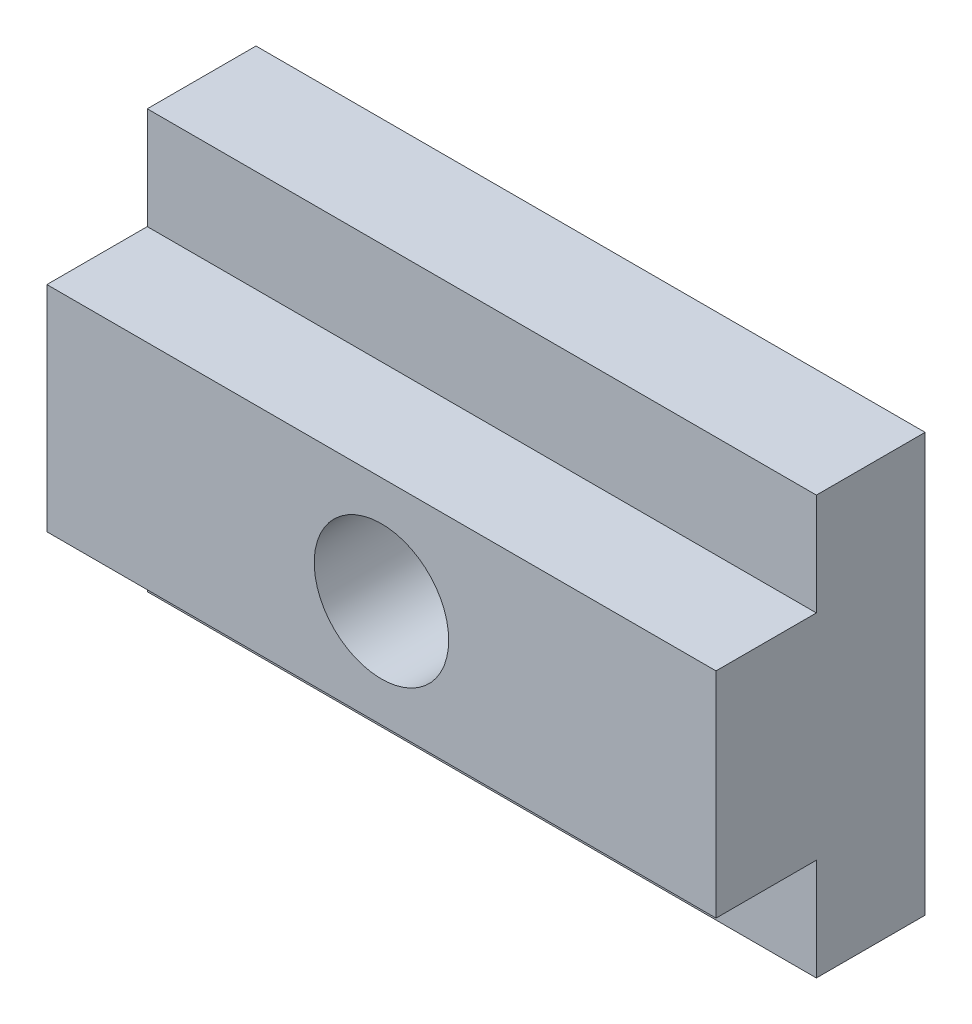
ISO-10303-21;
HEADER;
FILE_DESCRIPTION(('STEP AP214'),'2;1');
FILE_NAME('part.step','',(''),(''),'','','');
FILE_SCHEMA(('AUTOMOTIVE_DESIGN { 1 0 10303 214 1 1 1 1 }'));
ENDSEC;
DATA;
#1=APPLICATION_CONTEXT('core data for automotive mechanical design processes');
#2=APPLICATION_PROTOCOL_DEFINITION('international standard','automotive_design',2000,#1);
#3=PRODUCT_CONTEXT('',#1,'mechanical');
#4=PRODUCT('Part','Part','',(#3));
#5=PRODUCT_RELATED_PRODUCT_CATEGORY('part','',(#4));
#6=PRODUCT_DEFINITION_FORMATION('','',#4);
#7=PRODUCT_DEFINITION_CONTEXT('part definition',#1,'design');
#8=PRODUCT_DEFINITION('design','',#6,#7);
#9=PRODUCT_DEFINITION_SHAPE('','',#8);
#10=(LENGTH_UNIT() NAMED_UNIT(*) SI_UNIT(.MILLI.,.METRE.));
#11=(NAMED_UNIT(*) PLANE_ANGLE_UNIT() SI_UNIT($,.RADIAN.));
#12=(NAMED_UNIT(*) SI_UNIT($,.STERADIAN.) SOLID_ANGLE_UNIT());
#13=UNCERTAINTY_MEASURE_WITH_UNIT(LENGTH_MEASURE(1.E-05),#10,'distance_accuracy_value','');
#14=(GEOMETRIC_REPRESENTATION_CONTEXT(3) GLOBAL_UNCERTAINTY_ASSIGNED_CONTEXT((#13)) GLOBAL_UNIT_ASSIGNED_CONTEXT((#10,
#11,#12)) REPRESENTATION_CONTEXT('',''));
#15=CARTESIAN_POINT('',(0.,0.,0.));
#16=DIRECTION('',(0.,0.,1.));
#17=DIRECTION('',(1.,0.,0.));
#18=AXIS2_PLACEMENT_3D('',#15,#16,#17);
#19=CARTESIAN_POINT('',(12.7,7.9375,7.9375));
#20=DIRECTION('',(-1.,0.,0.));
#21=DIRECTION('',(0.,-1.,0.));
#22=AXIS2_PLACEMENT_3D('',#19,#20,#21);
#23=PLANE('',#22);
#24=DIRECTION('',(0.,1.,0.));
#25=VECTOR('',#24,1.);
#26=CARTESIAN_POINT('',(12.7,7.9375,7.9375));
#27=LINE('',#26,#25);
#28=CARTESIAN_POINT('',(12.7,-4.064,7.9375));
#29=VERTEX_POINT('',#28);
#30=CARTESIAN_POINT('',(12.7,4.064,7.9375));
#31=VERTEX_POINT('',#30);
#32=EDGE_CURVE('E125',#29,#31,#27,.T.);
#33=ORIENTED_EDGE('',*,*,#32,.F.);
#34=DIRECTION('',(0.,0.,1.));
#35=VECTOR('',#34,1.);
#36=CARTESIAN_POINT('',(12.7,-4.064,7.9375));
#37=LINE('',#36,#35);
#38=CARTESIAN_POINT('',(12.7,-4.064,4.1275));
#39=VERTEX_POINT('',#38);
#40=EDGE_CURVE('E48',#39,#29,#37,.T.);
#41=ORIENTED_EDGE('',*,*,#40,.F.);
#42=DIRECTION('',(0.,1.,0.));
#43=VECTOR('',#42,1.);
#44=CARTESIAN_POINT('',(12.7,-7.9375,4.1275));
#45=LINE('',#44,#43);
#46=CARTESIAN_POINT('',(12.7,-7.9375,4.1275));
#47=VERTEX_POINT('',#46);
#48=EDGE_CURVE('E101',#47,#39,#45,.T.);
#49=ORIENTED_EDGE('',*,*,#48,.F.);
#50=DIRECTION('',(0.,0.,-1.));
#51=VECTOR('',#50,1.);
#52=CARTESIAN_POINT('',(12.7,-7.9375,7.9375));
#53=LINE('',#52,#51);
#54=CARTESIAN_POINT('',(12.7,-7.9375,0.));
#55=VERTEX_POINT('',#54);
#56=EDGE_CURVE('E112',#47,#55,#53,.T.);
#57=ORIENTED_EDGE('',*,*,#56,.T.);
#58=DIRECTION('',(0.,1.,0.));
#59=VECTOR('',#58,1.);
#60=CARTESIAN_POINT('',(12.7,7.9375,0.));
#61=LINE('',#60,#59);
#62=CARTESIAN_POINT('',(12.7,7.9375,0.));
#63=VERTEX_POINT('',#62);
#64=EDGE_CURVE('E147',#55,#63,#61,.T.);
#65=ORIENTED_EDGE('',*,*,#64,.T.);
#66=DIRECTION('',(0.,0.,-1.));
#67=VECTOR('',#66,1.);
#68=CARTESIAN_POINT('',(12.7,7.9375,7.9375));
#69=LINE('',#68,#67);
#70=CARTESIAN_POINT('',(12.7,7.9375,4.1275));
#71=VERTEX_POINT('',#70);
#72=EDGE_CURVE('E11',#71,#63,#69,.T.);
#73=ORIENTED_EDGE('',*,*,#72,.F.);
#74=DIRECTION('',(0.,1.,0.));
#75=VECTOR('',#74,1.);
#76=CARTESIAN_POINT('',(12.7,7.9375,4.1275));
#77=LINE('',#76,#75);
#78=CARTESIAN_POINT('',(12.7,4.064,4.1275));
#79=VERTEX_POINT('',#78);
#80=EDGE_CURVE('E158',#79,#71,#77,.T.);
#81=ORIENTED_EDGE('',*,*,#80,.F.);
#82=DIRECTION('',(0.,0.,-1.));
#83=VECTOR('',#82,1.);
#84=CARTESIAN_POINT('',(12.7,4.064,7.9375));
#85=LINE('',#84,#83);
#86=EDGE_CURVE('E162',#31,#79,#85,.T.);
#87=ORIENTED_EDGE('',*,*,#86,.F.);
#88=EDGE_LOOP('',(#33,#41,#49,#57,#65,#73,#81,#87));
#89=FACE_BOUND('',#88,.T.);
#90=ADVANCED_FACE('F33',(#89),#23,.F.);
#91=CARTESIAN_POINT('',(-12.7,7.9375,7.9375));
#92=DIRECTION('',(0.,-1.,0.));
#93=DIRECTION('',(0.,0.,-1.));
#94=AXIS2_PLACEMENT_3D('',#91,#92,#93);
#95=PLANE('',#94);
#96=DIRECTION('',(0.,0.,-1.));
#97=VECTOR('',#96,1.);
#98=CARTESIAN_POINT('',(-12.7,7.9375,7.9375));
#99=LINE('',#98,#97);
#100=CARTESIAN_POINT('',(-12.7,7.9375,4.1275));
#101=VERTEX_POINT('',#100);
#102=CARTESIAN_POINT('',(-12.7,7.9375,0.));
#103=VERTEX_POINT('',#102);
#104=EDGE_CURVE('E41',#101,#103,#99,.T.);
#105=ORIENTED_EDGE('',*,*,#104,.F.);
#106=DIRECTION('',(1.,0.,0.));
#107=VECTOR('',#106,1.);
#108=CARTESIAN_POINT('',(-12.701,7.9375,4.1275));
#109=LINE('',#108,#107);
#110=EDGE_CURVE('E154',#101,#71,#109,.T.);
#111=ORIENTED_EDGE('',*,*,#110,.T.);
#112=ORIENTED_EDGE('',*,*,#72,.T.);
#113=DIRECTION('',(-1.,0.,0.));
#114=VECTOR('',#113,1.);
#115=CARTESIAN_POINT('',(-12.7,7.9375,0.));
#116=LINE('',#115,#114);
#117=EDGE_CURVE('E143',#63,#103,#116,.T.);
#118=ORIENTED_EDGE('',*,*,#117,.T.);
#119=EDGE_LOOP('',(#105,#111,#112,#118));
#120=FACE_BOUND('',#119,.T.);
#121=ADVANCED_FACE('F144',(#120),#95,.F.);
#122=CARTESIAN_POINT('',(-12.7,7.9375,7.9375));
#123=DIRECTION('',(1.,0.,0.));
#124=DIRECTION('',(0.,0.,-1.));
#125=AXIS2_PLACEMENT_3D('',#122,#123,#124);
#126=PLANE('',#125);
#127=DIRECTION('',(0.,-1.,0.));
#128=VECTOR('',#127,1.);
#129=CARTESIAN_POINT('',(-12.7,-7.9375,4.1275));
#130=LINE('',#129,#128);
#131=CARTESIAN_POINT('',(-12.7,-4.064,4.1275));
#132=VERTEX_POINT('',#131);
#133=CARTESIAN_POINT('',(-12.7,-7.9375,4.1275));
#134=VERTEX_POINT('',#133);
#135=EDGE_CURVE('E103',#132,#134,#130,.T.);
#136=ORIENTED_EDGE('',*,*,#135,.F.);
#137=DIRECTION('',(0.,0.,-1.));
#138=VECTOR('',#137,1.);
#139=CARTESIAN_POINT('',(-12.7,-4.064,7.9375));
#140=LINE('',#139,#138);
#141=CARTESIAN_POINT('',(-12.7,-4.064,7.9375));
#142=VERTEX_POINT('',#141);
#143=EDGE_CURVE('E114',#142,#132,#140,.T.);
#144=ORIENTED_EDGE('',*,*,#143,.F.);
#145=DIRECTION('',(0.,-1.,0.));
#146=VECTOR('',#145,1.);
#147=CARTESIAN_POINT('',(-12.7,7.9375,7.9375));
#148=LINE('',#147,#146);
#149=CARTESIAN_POINT('',(-12.7,4.064,7.9375));
#150=VERTEX_POINT('',#149);
#151=EDGE_CURVE('E121',#150,#142,#148,.T.);
#152=ORIENTED_EDGE('',*,*,#151,.F.);
#153=DIRECTION('',(0.,0.,1.));
#154=VECTOR('',#153,1.);
#155=CARTESIAN_POINT('',(-12.7,4.064,7.9375));
#156=LINE('',#155,#154);
#157=CARTESIAN_POINT('',(-12.7,4.064,4.1275));
#158=VERTEX_POINT('',#157);
#159=EDGE_CURVE('E56',#158,#150,#156,.T.);
#160=ORIENTED_EDGE('',*,*,#159,.F.);
#161=DIRECTION('',(0.,-1.,0.));
#162=VECTOR('',#161,1.);
#163=CARTESIAN_POINT('',(-12.7,7.9375,4.1275));
#164=LINE('',#163,#162);
#165=EDGE_CURVE('E139',#101,#158,#164,.T.);
#166=ORIENTED_EDGE('',*,*,#165,.F.);
#167=ORIENTED_EDGE('',*,*,#104,.T.);
#168=DIRECTION('',(0.,-1.,0.));
#169=VECTOR('',#168,1.);
#170=CARTESIAN_POINT('',(-12.7,7.9375,0.));
#171=LINE('',#170,#169);
#172=CARTESIAN_POINT('',(-12.7,-7.9375,0.));
#173=VERTEX_POINT('',#172);
#174=EDGE_CURVE('E137',#103,#173,#171,.T.);
#175=ORIENTED_EDGE('',*,*,#174,.T.);
#176=DIRECTION('',(0.,0.,-1.));
#177=VECTOR('',#176,1.);
#178=CARTESIAN_POINT('',(-12.7,-7.9375,7.9375));
#179=LINE('',#178,#177);
#180=EDGE_CURVE('E120',#134,#173,#179,.T.);
#181=ORIENTED_EDGE('',*,*,#180,.F.);
#182=EDGE_LOOP('',(#136,#144,#152,#160,#166,#167,#175,#181));
#183=FACE_BOUND('',#182,.T.);
#184=ADVANCED_FACE('F135',(#183),#126,.F.);
#185=CARTESIAN_POINT('',(-12.7,-7.9375,7.9375));
#186=DIRECTION('',(0.,1.,0.));
#187=DIRECTION('',(0.,0.,1.));
#188=AXIS2_PLACEMENT_3D('',#185,#186,#187);
#189=PLANE('',#188);
#190=ORIENTED_EDGE('',*,*,#56,.F.);
#191=DIRECTION('',(1.,0.,0.));
#192=VECTOR('',#191,1.);
#193=CARTESIAN_POINT('',(-12.701,-7.9375,4.1275));
#194=LINE('',#193,#192);
#195=EDGE_CURVE('E98',#134,#47,#194,.T.);
#196=ORIENTED_EDGE('',*,*,#195,.F.);
#197=ORIENTED_EDGE('',*,*,#180,.T.);
#198=DIRECTION('',(1.,0.,0.));
#199=VECTOR('',#198,1.);
#200=CARTESIAN_POINT('',(-12.7,-7.9375,0.));
#201=LINE('',#200,#199);
#202=EDGE_CURVE('E118',#173,#55,#201,.T.);
#203=ORIENTED_EDGE('',*,*,#202,.T.);
#204=EDGE_LOOP('',(#190,#196,#197,#203));
#205=FACE_BOUND('',#204,.T.);
#206=ADVANCED_FACE('F116',(#205),#189,.F.);
#207=CARTESIAN_POINT('',(0.,0.,7.9375));
#208=DIRECTION('',(0.,0.,1.));
#209=DIRECTION('',(1.,0.,0.));
#210=AXIS2_PLACEMENT_3D('',#207,#208,#209);
#211=PLANE('',#210);
#212=CARTESIAN_POINT('',(0.,0.,7.9375));
#213=DIRECTION('',(0.,0.,1.));
#214=DIRECTION('',(1.,0.,0.));
#215=AXIS2_PLACEMENT_3D('',#212,#213,#214);
#216=CIRCLE('',#215,2.5527);
#217=CARTESIAN_POINT('',(2.5527,0.,7.9375));
#218=VERTEX_POINT('',#217);
#219=EDGE_CURVE('E173',#218,#218,#216,.T.);
#220=ORIENTED_EDGE('',*,*,#219,.F.);
#221=EDGE_LOOP('',(#220));
#222=FACE_BOUND('',#221,.T.);
#223=DIRECTION('',(1.,0.,0.));
#224=VECTOR('',#223,1.);
#225=CARTESIAN_POINT('',(-12.701,-4.064,7.9375));
#226=LINE('',#225,#224);
#227=EDGE_CURVE('E165',#142,#29,#226,.T.);
#228=ORIENTED_EDGE('',*,*,#227,.T.);
#229=ORIENTED_EDGE('',*,*,#32,.T.);
#230=DIRECTION('',(1.,0.,0.));
#231=VECTOR('',#230,1.);
#232=CARTESIAN_POINT('',(-12.701,4.064,7.9375));
#233=LINE('',#232,#231);
#234=EDGE_CURVE('E155',#150,#31,#233,.T.);
#235=ORIENTED_EDGE('',*,*,#234,.F.);
#236=ORIENTED_EDGE('',*,*,#151,.T.);
#237=EDGE_LOOP('',(#228,#229,#235,#236));
#238=FACE_BOUND('',#237,.T.);
#239=ADVANCED_FACE('F201',(#222,#238),#211,.T.);
#240=CARTESIAN_POINT('',(0.,0.,0.));
#241=DIRECTION('',(0.,0.,1.));
#242=DIRECTION('',(1.,0.,0.));
#243=AXIS2_PLACEMENT_3D('',#240,#241,#242);
#244=PLANE('',#243);
#245=CARTESIAN_POINT('',(0.,0.,0.));
#246=DIRECTION('',(0.,0.,1.));
#247=DIRECTION('',(1.,0.,0.));
#248=AXIS2_PLACEMENT_3D('',#245,#246,#247);
#249=CIRCLE('',#248,2.5527);
#250=CARTESIAN_POINT('',(2.5527,0.,0.));
#251=VERTEX_POINT('',#250);
#252=EDGE_CURVE('E36',#251,#251,#249,.T.);
#253=ORIENTED_EDGE('',*,*,#252,.T.);
#254=EDGE_LOOP('',(#253));
#255=FACE_BOUND('',#254,.T.);
#256=ORIENTED_EDGE('',*,*,#64,.F.);
#257=ORIENTED_EDGE('',*,*,#202,.F.);
#258=ORIENTED_EDGE('',*,*,#174,.F.);
#259=ORIENTED_EDGE('',*,*,#117,.F.);
#260=EDGE_LOOP('',(#256,#257,#258,#259));
#261=FACE_BOUND('',#260,.T.);
#262=ADVANCED_FACE('F149',(#255,#261),#244,.F.);
#263=CARTESIAN_POINT('',(-12.701,7.9375,4.1275));
#264=DIRECTION('',(0.,0.,-1.));
#265=DIRECTION('',(0.,1.,0.));
#266=AXIS2_PLACEMENT_3D('',#263,#264,#265);
#267=PLANE('',#266);
#268=ORIENTED_EDGE('',*,*,#165,.T.);
#269=DIRECTION('',(1.,0.,0.));
#270=VECTOR('',#269,1.);
#271=CARTESIAN_POINT('',(-12.701,4.064,4.1275));
#272=LINE('',#271,#270);
#273=EDGE_CURVE('E157',#158,#79,#272,.T.);
#274=ORIENTED_EDGE('',*,*,#273,.T.);
#275=ORIENTED_EDGE('',*,*,#80,.T.);
#276=ORIENTED_EDGE('',*,*,#110,.F.);
#277=EDGE_LOOP('',(#268,#274,#275,#276));
#278=FACE_BOUND('',#277,.T.);
#279=ADVANCED_FACE('F204',(#278),#267,.F.);
#280=CARTESIAN_POINT('',(-12.701,4.064,7.9375));
#281=DIRECTION('',(0.,-1.,0.));
#282=DIRECTION('',(1.,0.,0.));
#283=AXIS2_PLACEMENT_3D('',#280,#281,#282);
#284=PLANE('',#283);
#285=ORIENTED_EDGE('',*,*,#159,.T.);
#286=ORIENTED_EDGE('',*,*,#234,.T.);
#287=ORIENTED_EDGE('',*,*,#86,.T.);
#288=ORIENTED_EDGE('',*,*,#273,.F.);
#289=EDGE_LOOP('',(#285,#286,#287,#288));
#290=FACE_BOUND('',#289,.T.);
#291=ADVANCED_FACE('F208',(#290),#284,.F.);
#292=CARTESIAN_POINT('',(-12.701,-4.064,7.9375));
#293=DIRECTION('',(0.,1.,0.));
#294=DIRECTION('',(-1.,0.,0.));
#295=AXIS2_PLACEMENT_3D('',#292,#293,#294);
#296=PLANE('',#295);
#297=ORIENTED_EDGE('',*,*,#143,.T.);
#298=DIRECTION('',(1.,0.,0.));
#299=VECTOR('',#298,1.);
#300=CARTESIAN_POINT('',(-12.701,-4.064,4.1275));
#301=LINE('',#300,#299);
#302=EDGE_CURVE('E107',#132,#39,#301,.T.);
#303=ORIENTED_EDGE('',*,*,#302,.T.);
#304=ORIENTED_EDGE('',*,*,#40,.T.);
#305=ORIENTED_EDGE('',*,*,#227,.F.);
#306=EDGE_LOOP('',(#297,#303,#304,#305));
#307=FACE_BOUND('',#306,.T.);
#308=ADVANCED_FACE('F187',(#307),#296,.F.);
#309=CARTESIAN_POINT('',(-12.701,-7.9375,4.1275));
#310=DIRECTION('',(0.,0.,-1.));
#311=DIRECTION('',(-1.,0.,0.));
#312=AXIS2_PLACEMENT_3D('',#309,#310,#311);
#313=PLANE('',#312);
#314=ORIENTED_EDGE('',*,*,#135,.T.);
#315=ORIENTED_EDGE('',*,*,#195,.T.);
#316=ORIENTED_EDGE('',*,*,#48,.T.);
#317=ORIENTED_EDGE('',*,*,#302,.F.);
#318=EDGE_LOOP('',(#314,#315,#316,#317));
#319=FACE_BOUND('',#318,.T.);
#320=ADVANCED_FACE('F100',(#319),#313,.F.);
#321=CARTESIAN_POINT('',(0.,0.,7.9375));
#322=DIRECTION('',(0.,0.,1.));
#323=DIRECTION('',(1.,0.,0.));
#324=AXIS2_PLACEMENT_3D('',#321,#322,#323);
#325=CYLINDRICAL_SURFACE('',#324,2.5527);
#326=ORIENTED_EDGE('',*,*,#219,.T.);
#327=EDGE_LOOP('',(#326));
#328=FACE_BOUND('',#327,.T.);
#329=ORIENTED_EDGE('',*,*,#252,.F.);
#330=EDGE_LOOP('',(#329));
#331=FACE_BOUND('',#330,.T.);
#332=ADVANCED_FACE('F181',(#328,#331),#325,.F.);
#333=CLOSED_SHELL('',(#90,#121,#184,#206,#239,#262,#279,#291,#308,#320,#332));
#334=MANIFOLD_SOLID_BREP('B2',#333);
#335=ADVANCED_BREP_SHAPE_REPRESENTATION('',(#18,#334),#14);
#336=SHAPE_DEFINITION_REPRESENTATION(#9,#335);
ENDSEC;
END-ISO-10303-21;
